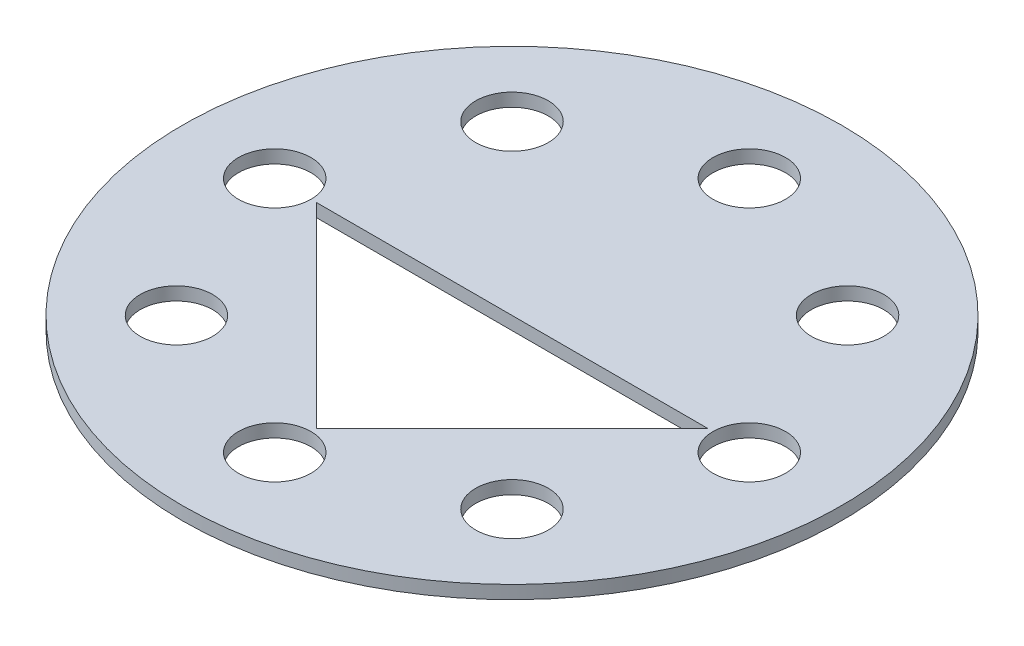
ISO-10303-21;
HEADER;
FILE_DESCRIPTION(('STEP AP214'),'2;1');
FILE_NAME('part.step','',(''),(''),'','','');
FILE_SCHEMA(('AUTOMOTIVE_DESIGN { 1 0 10303 214 1 1 1 1 }'));
ENDSEC;
DATA;
#1=APPLICATION_CONTEXT('core data for automotive mechanical design processes');
#2=APPLICATION_PROTOCOL_DEFINITION('international standard','automotive_design',2000,#1);
#3=PRODUCT_CONTEXT('',#1,'mechanical');
#4=PRODUCT('Part','Part','',(#3));
#5=PRODUCT_RELATED_PRODUCT_CATEGORY('part','',(#4));
#6=PRODUCT_DEFINITION_FORMATION('','',#4);
#7=PRODUCT_DEFINITION_CONTEXT('part definition',#1,'design');
#8=PRODUCT_DEFINITION('design','',#6,#7);
#9=PRODUCT_DEFINITION_SHAPE('','',#8);
#10=(LENGTH_UNIT() NAMED_UNIT(*) SI_UNIT(.MILLI.,.METRE.));
#11=(NAMED_UNIT(*) PLANE_ANGLE_UNIT() SI_UNIT($,.RADIAN.));
#12=(NAMED_UNIT(*) SI_UNIT($,.STERADIAN.) SOLID_ANGLE_UNIT());
#13=UNCERTAINTY_MEASURE_WITH_UNIT(LENGTH_MEASURE(1.E-05),#10,'distance_accuracy_value','');
#14=(GEOMETRIC_REPRESENTATION_CONTEXT(3) GLOBAL_UNCERTAINTY_ASSIGNED_CONTEXT((#13)) GLOBAL_UNIT_ASSIGNED_CONTEXT((#10,
#11,#12)) REPRESENTATION_CONTEXT('',''));
#15=CARTESIAN_POINT('',(0.,0.,0.));
#16=DIRECTION('',(0.,0.,1.));
#17=DIRECTION('',(1.,0.,0.));
#18=AXIS2_PLACEMENT_3D('',#15,#16,#17);
#19=CARTESIAN_POINT('',(0.,1.,0.));
#20=DIRECTION('',(0.,-1.,0.));
#21=DIRECTION('',(0.,0.,-1.));
#22=AXIS2_PLACEMENT_3D('',#19,#20,#21);
#23=CYLINDRICAL_SURFACE('',#22,25.);
#24=CARTESIAN_POINT('',(0.,3.,0.));
#25=DIRECTION('',(0.,1.,0.));
#26=DIRECTION('',(0.,0.,1.));
#27=AXIS2_PLACEMENT_3D('',#24,#25,#26);
#28=CIRCLE('',#27,25.);
#29=CARTESIAN_POINT('',(0.,3.,25.));
#30=VERTEX_POINT('',#29);
#31=EDGE_CURVE('E90',#30,#30,#28,.T.);
#32=ORIENTED_EDGE('',*,*,#31,.F.);
#33=EDGE_LOOP('',(#32));
#34=FACE_BOUND('',#33,.T.);
#35=CARTESIAN_POINT('',(0.,2.,0.));
#36=DIRECTION('',(0.,-1.,0.));
#37=DIRECTION('',(0.,0.,-1.));
#38=AXIS2_PLACEMENT_3D('',#35,#36,#37);
#39=CIRCLE('',#38,25.);
#40=CARTESIAN_POINT('',(0.,2.,-25.));
#41=VERTEX_POINT('',#40);
#42=EDGE_CURVE('E151',#41,#41,#39,.T.);
#43=ORIENTED_EDGE('',*,*,#42,.F.);
#44=EDGE_LOOP('',(#43));
#45=FACE_BOUND('',#44,.T.);
#46=ADVANCED_FACE('F37',(#34,#45),#23,.T.);
#47=CARTESIAN_POINT('',(18.,3.,0.));
#48=DIRECTION('',(0.,-1.,0.));
#49=DIRECTION('',(0.,0.,-1.));
#50=AXIS2_PLACEMENT_3D('',#47,#48,#49);
#51=CYLINDRICAL_SURFACE('',#50,2.75);
#52=CARTESIAN_POINT('',(18.,3.,0.));
#53=DIRECTION('',(0.,1.,0.));
#54=DIRECTION('',(0.,0.,1.));
#55=AXIS2_PLACEMENT_3D('',#52,#53,#54);
#56=CIRCLE('',#55,2.75);
#57=CARTESIAN_POINT('',(18.,3.,2.75));
#58=VERTEX_POINT('',#57);
#59=EDGE_CURVE('E96',#58,#58,#56,.T.);
#60=ORIENTED_EDGE('',*,*,#59,.T.);
#61=EDGE_LOOP('',(#60));
#62=FACE_BOUND('',#61,.T.);
#63=CARTESIAN_POINT('',(18.,2.,0.));
#64=DIRECTION('',(0.,-1.,0.));
#65=DIRECTION('',(0.,0.,-1.));
#66=AXIS2_PLACEMENT_3D('',#63,#64,#65);
#67=CIRCLE('',#66,2.75);
#68=CARTESIAN_POINT('',(18.,2.,-2.75));
#69=VERTEX_POINT('',#68);
#70=EDGE_CURVE('E82',#69,#69,#67,.T.);
#71=ORIENTED_EDGE('',*,*,#70,.T.);
#72=EDGE_LOOP('',(#71));
#73=FACE_BOUND('',#72,.T.);
#74=ADVANCED_FACE('F176',(#62,#73),#51,.F.);
#75=CARTESIAN_POINT('',(12.7279220613578,3.,12.7279220613579));
#76=DIRECTION('',(0.,-1.,0.));
#77=DIRECTION('',(0.,0.,-1.));
#78=AXIS2_PLACEMENT_3D('',#75,#76,#77);
#79=CYLINDRICAL_SURFACE('',#78,2.75);
#80=CARTESIAN_POINT('',(12.7279220613578,3.,12.7279220613579));
#81=DIRECTION('',(0.,1.,0.));
#82=DIRECTION('',(-0.707106781186549,0.,0.707106781186546));
#83=AXIS2_PLACEMENT_3D('',#80,#81,#82);
#84=CIRCLE('',#83,2.75);
#85=CARTESIAN_POINT('',(10.7833784130948,3.,14.6724657096209));
#86=VERTEX_POINT('',#85);
#87=EDGE_CURVE('E100',#86,#86,#84,.T.);
#88=ORIENTED_EDGE('',*,*,#87,.T.);
#89=EDGE_LOOP('',(#88));
#90=FACE_BOUND('',#89,.T.);
#91=CARTESIAN_POINT('',(12.7279220613578,2.,12.7279220613579));
#92=DIRECTION('',(0.,-1.,0.));
#93=DIRECTION('',(0.,0.,-1.));
#94=AXIS2_PLACEMENT_3D('',#91,#92,#93);
#95=CIRCLE('',#94,2.75);
#96=CARTESIAN_POINT('',(12.7279220613578,2.,9.97792206135788));
#97=VERTEX_POINT('',#96);
#98=EDGE_CURVE('E171',#97,#97,#95,.T.);
#99=ORIENTED_EDGE('',*,*,#98,.T.);
#100=EDGE_LOOP('',(#99));
#101=FACE_BOUND('',#100,.T.);
#102=ADVANCED_FACE('F130',(#90,#101),#79,.F.);
#103=CARTESIAN_POINT('',(0.,3.,18.));
#104=DIRECTION('',(0.,-1.,0.));
#105=DIRECTION('',(0.,0.,-1.));
#106=AXIS2_PLACEMENT_3D('',#103,#104,#105);
#107=CYLINDRICAL_SURFACE('',#106,2.75);
#108=CARTESIAN_POINT('',(0.,3.,18.));
#109=DIRECTION('',(0.,1.,0.));
#110=DIRECTION('',(-1.,0.,0.));
#111=AXIS2_PLACEMENT_3D('',#108,#109,#110);
#112=CIRCLE('',#111,2.75);
#113=CARTESIAN_POINT('',(-2.75000000000006,3.,18.));
#114=VERTEX_POINT('',#113);
#115=EDGE_CURVE('E125',#114,#114,#112,.T.);
#116=ORIENTED_EDGE('',*,*,#115,.T.);
#117=EDGE_LOOP('',(#116));
#118=FACE_BOUND('',#117,.T.);
#119=CARTESIAN_POINT('',(0.,2.,18.));
#120=DIRECTION('',(0.,-1.,0.));
#121=DIRECTION('',(0.,0.,-1.));
#122=AXIS2_PLACEMENT_3D('',#119,#120,#121);
#123=CIRCLE('',#122,2.75);
#124=CARTESIAN_POINT('',(0.,2.,15.25));
#125=VERTEX_POINT('',#124);
#126=EDGE_CURVE('E168',#125,#125,#123,.T.);
#127=ORIENTED_EDGE('',*,*,#126,.T.);
#128=EDGE_LOOP('',(#127));
#129=FACE_BOUND('',#128,.T.);
#130=ADVANCED_FACE('F216',(#118,#129),#107,.F.);
#131=CARTESIAN_POINT('',(-12.7279220613579,3.,12.7279220613578));
#132=DIRECTION('',(0.,-1.,0.));
#133=DIRECTION('',(0.,0.,-1.));
#134=AXIS2_PLACEMENT_3D('',#131,#132,#133);
#135=CYLINDRICAL_SURFACE('',#134,2.75);
#136=CARTESIAN_POINT('',(-12.7279220613579,3.,12.7279220613578));
#137=DIRECTION('',(0.,1.,0.));
#138=DIRECTION('',(-0.707106781186544,0.,-0.707106781186551));
#139=AXIS2_PLACEMENT_3D('',#136,#137,#138);
#140=CIRCLE('',#139,2.75);
#141=CARTESIAN_POINT('',(-14.6724657096209,3.,10.7833784130948));
#142=VERTEX_POINT('',#141);
#143=EDGE_CURVE('E122',#142,#142,#140,.T.);
#144=ORIENTED_EDGE('',*,*,#143,.T.);
#145=EDGE_LOOP('',(#144));
#146=FACE_BOUND('',#145,.T.);
#147=CARTESIAN_POINT('',(-12.7279220613579,2.,12.7279220613578));
#148=DIRECTION('',(0.,-1.,0.));
#149=DIRECTION('',(0.,0.,-1.));
#150=AXIS2_PLACEMENT_3D('',#147,#148,#149);
#151=CIRCLE('',#150,2.75);
#152=CARTESIAN_POINT('',(-12.7279220613579,2.,9.97792206135779));
#153=VERTEX_POINT('',#152);
#154=EDGE_CURVE('E165',#153,#153,#151,.T.);
#155=ORIENTED_EDGE('',*,*,#154,.T.);
#156=EDGE_LOOP('',(#155));
#157=FACE_BOUND('',#156,.T.);
#158=ADVANCED_FACE('F257',(#146,#157),#135,.F.);
#159=CARTESIAN_POINT('',(-18.,3.,0.));
#160=DIRECTION('',(0.,-1.,0.));
#161=DIRECTION('',(0.,0.,-1.));
#162=AXIS2_PLACEMENT_3D('',#159,#160,#161);
#163=CYLINDRICAL_SURFACE('',#162,2.75);
#164=CARTESIAN_POINT('',(-18.,3.,0.));
#165=DIRECTION('',(0.,1.,0.));
#166=DIRECTION('',(0.,0.,-1.));
#167=AXIS2_PLACEMENT_3D('',#164,#165,#166);
#168=CIRCLE('',#167,2.75);
#169=CARTESIAN_POINT('',(-18.,3.,-2.75));
#170=VERTEX_POINT('',#169);
#171=EDGE_CURVE('E119',#170,#170,#168,.T.);
#172=ORIENTED_EDGE('',*,*,#171,.T.);
#173=EDGE_LOOP('',(#172));
#174=FACE_BOUND('',#173,.T.);
#175=CARTESIAN_POINT('',(-18.,2.,0.));
#176=DIRECTION('',(0.,-1.,0.));
#177=DIRECTION('',(0.,0.,-1.));
#178=AXIS2_PLACEMENT_3D('',#175,#176,#177);
#179=CIRCLE('',#178,2.75);
#180=CARTESIAN_POINT('',(-18.,2.,-2.75));
#181=VERTEX_POINT('',#180);
#182=EDGE_CURVE('E162',#181,#181,#179,.T.);
#183=ORIENTED_EDGE('',*,*,#182,.T.);
#184=EDGE_LOOP('',(#183));
#185=FACE_BOUND('',#184,.T.);
#186=ADVANCED_FACE('F199',(#174,#185),#163,.F.);
#187=CARTESIAN_POINT('',(-12.7279220613577,3.,-12.727922061358));
#188=DIRECTION('',(0.,-1.,0.));
#189=DIRECTION('',(0.,0.,-1.));
#190=AXIS2_PLACEMENT_3D('',#187,#188,#189);
#191=CYLINDRICAL_SURFACE('',#190,2.75);
#192=CARTESIAN_POINT('',(-12.7279220613577,3.,-12.727922061358));
#193=DIRECTION('',(0.,1.,0.));
#194=DIRECTION('',(0.707106781186554,0.,-0.707106781186541));
#195=AXIS2_PLACEMENT_3D('',#192,#193,#194);
#196=CIRCLE('',#195,2.75);
#197=CARTESIAN_POINT('',(-10.7833784130947,3.,-14.672465709621));
#198=VERTEX_POINT('',#197);
#199=EDGE_CURVE('E116',#198,#198,#196,.T.);
#200=ORIENTED_EDGE('',*,*,#199,.T.);
#201=EDGE_LOOP('',(#200));
#202=FACE_BOUND('',#201,.T.);
#203=CARTESIAN_POINT('',(-12.7279220613577,2.,-12.727922061358));
#204=DIRECTION('',(0.,-1.,0.));
#205=DIRECTION('',(0.,0.,-1.));
#206=AXIS2_PLACEMENT_3D('',#203,#204,#205);
#207=CIRCLE('',#206,2.75);
#208=CARTESIAN_POINT('',(-12.7279220613577,2.,-15.477922061358));
#209=VERTEX_POINT('',#208);
#210=EDGE_CURVE('E153',#209,#209,#207,.T.);
#211=ORIENTED_EDGE('',*,*,#210,.T.);
#212=EDGE_LOOP('',(#211));
#213=FACE_BOUND('',#212,.T.);
#214=ADVANCED_FACE('F193',(#202,#213),#191,.F.);
#215=CARTESIAN_POINT('',(1.88539992297529E-13,3.,-18.));
#216=DIRECTION('',(0.,-1.,0.));
#217=DIRECTION('',(0.,0.,-1.));
#218=AXIS2_PLACEMENT_3D('',#215,#216,#217);
#219=CYLINDRICAL_SURFACE('',#218,2.75);
#220=CARTESIAN_POINT('',(1.88539992297529E-13,3.,-18.));
#221=DIRECTION('',(0.,1.,0.));
#222=DIRECTION('',(1.,0.,0.));
#223=AXIS2_PLACEMENT_3D('',#220,#221,#222);
#224=CIRCLE('',#223,2.75);
#225=CARTESIAN_POINT('',(2.75000000000019,3.,-18.));
#226=VERTEX_POINT('',#225);
#227=EDGE_CURVE('E113',#226,#226,#224,.T.);
#228=ORIENTED_EDGE('',*,*,#227,.T.);
#229=EDGE_LOOP('',(#228));
#230=FACE_BOUND('',#229,.T.);
#231=CARTESIAN_POINT('',(1.88539992297529E-13,2.,-18.));
#232=DIRECTION('',(0.,-1.,0.));
#233=DIRECTION('',(0.,0.,-1.));
#234=AXIS2_PLACEMENT_3D('',#231,#232,#233);
#235=CIRCLE('',#234,2.75);
#236=CARTESIAN_POINT('',(1.88539992297529E-13,2.,-20.75));
#237=VERTEX_POINT('',#236);
#238=EDGE_CURVE('E150',#237,#237,#235,.T.);
#239=ORIENTED_EDGE('',*,*,#238,.T.);
#240=EDGE_LOOP('',(#239));
#241=FACE_BOUND('',#240,.T.);
#242=ADVANCED_FACE('F145',(#230,#241),#219,.F.);
#243=CARTESIAN_POINT('',(12.727922061358,3.,-12.7279220613577));
#244=DIRECTION('',(0.,-1.,0.));
#245=DIRECTION('',(0.,0.,-1.));
#246=AXIS2_PLACEMENT_3D('',#243,#244,#245);
#247=CYLINDRICAL_SURFACE('',#246,2.75);
#248=CARTESIAN_POINT('',(12.727922061358,3.,-12.7279220613577));
#249=DIRECTION('',(0.,1.,0.));
#250=DIRECTION('',(0.707106781186539,0.,0.707106781186556));
#251=AXIS2_PLACEMENT_3D('',#248,#249,#250);
#252=CIRCLE('',#251,2.75);
#253=CARTESIAN_POINT('',(14.672465709621,3.,-10.7833784130947));
#254=VERTEX_POINT('',#253);
#255=EDGE_CURVE('E76',#254,#254,#252,.T.);
#256=ORIENTED_EDGE('',*,*,#255,.T.);
#257=EDGE_LOOP('',(#256));
#258=FACE_BOUND('',#257,.T.);
#259=CARTESIAN_POINT('',(12.727922061358,2.,-12.7279220613577));
#260=DIRECTION('',(0.,-1.,0.));
#261=DIRECTION('',(0.,0.,-1.));
#262=AXIS2_PLACEMENT_3D('',#259,#260,#261);
#263=CIRCLE('',#262,2.75);
#264=CARTESIAN_POINT('',(12.727922061358,2.,-15.4779220613577));
#265=VERTEX_POINT('',#264);
#266=EDGE_CURVE('E40',#265,#265,#263,.T.);
#267=ORIENTED_EDGE('',*,*,#266,.T.);
#268=EDGE_LOOP('',(#267));
#269=FACE_BOUND('',#268,.T.);
#270=ADVANCED_FACE('F134',(#258,#269),#247,.F.);
#271=CARTESIAN_POINT('',(0.,3.,0.));
#272=DIRECTION('',(0.,1.,0.));
#273=DIRECTION('',(0.,0.,1.));
#274=AXIS2_PLACEMENT_3D('',#271,#272,#273);
#275=PLANE('',#274);
#276=ORIENTED_EDGE('',*,*,#227,.F.);
#277=EDGE_LOOP('',(#276));
#278=FACE_BOUND('',#277,.T.);
#279=ORIENTED_EDGE('',*,*,#171,.F.);
#280=EDGE_LOOP('',(#279));
#281=FACE_BOUND('',#280,.T.);
#282=ORIENTED_EDGE('',*,*,#115,.F.);
#283=EDGE_LOOP('',(#282));
#284=FACE_BOUND('',#283,.T.);
#285=ORIENTED_EDGE('',*,*,#59,.F.);
#286=EDGE_LOOP('',(#285));
#287=FACE_BOUND('',#286,.T.);
#288=ORIENTED_EDGE('',*,*,#31,.T.);
#289=EDGE_LOOP('',(#288));
#290=FACE_BOUND('',#289,.T.);
#291=DIRECTION('',(0.707106781186546,0.,-0.707106781186549));
#292=VECTOR('',#291,1.);
#293=CARTESIAN_POINT('',(14.8492424049176,3.,0.));
#294=LINE('',#293,#292);
#295=CARTESIAN_POINT('',(0.,3.,14.8492424049177));
#296=VERTEX_POINT('',#295);
#297=CARTESIAN_POINT('',(14.8492424049176,3.,0.));
#298=VERTEX_POINT('',#297);
#299=EDGE_CURVE('E91',#296,#298,#294,.T.);
#300=ORIENTED_EDGE('',*,*,#299,.F.);
#301=DIRECTION('',(0.707106781186546,0.,0.707106781186549));
#302=VECTOR('',#301,1.);
#303=CARTESIAN_POINT('',(0.,3.,14.8492424049177));
#304=LINE('',#303,#302);
#305=CARTESIAN_POINT('',(-14.8492424049176,3.,0.));
#306=VERTEX_POINT('',#305);
#307=EDGE_CURVE('E93',#306,#296,#304,.T.);
#308=ORIENTED_EDGE('',*,*,#307,.F.);
#309=DIRECTION('',(-1.,0.,0.));
#310=VECTOR('',#309,1.);
#311=CARTESIAN_POINT('',(-14.8492424049176,3.,0.));
#312=LINE('',#311,#310);
#313=EDGE_CURVE('E86',#298,#306,#312,.T.);
#314=ORIENTED_EDGE('',*,*,#313,.F.);
#315=EDGE_LOOP('',(#300,#308,#314));
#316=FACE_BOUND('',#315,.T.);
#317=ORIENTED_EDGE('',*,*,#87,.F.);
#318=EDGE_LOOP('',(#317));
#319=FACE_BOUND('',#318,.T.);
#320=ORIENTED_EDGE('',*,*,#143,.F.);
#321=EDGE_LOOP('',(#320));
#322=FACE_BOUND('',#321,.T.);
#323=ORIENTED_EDGE('',*,*,#199,.F.);
#324=EDGE_LOOP('',(#323));
#325=FACE_BOUND('',#324,.T.);
#326=ORIENTED_EDGE('',*,*,#255,.F.);
#327=EDGE_LOOP('',(#326));
#328=FACE_BOUND('',#327,.T.);
#329=ADVANCED_FACE('F94',(#278,#281,#284,#287,#290,#316,#319,#322,#325,#328),#275,.T.);
#330=CARTESIAN_POINT('',(0.,0.,14.8492424049177));
#331=DIRECTION('',(-0.707106781186549,0.,-0.707106781186546));
#332=DIRECTION('',(-0.707106781186546,0.,0.707106781186549));
#333=AXIS2_PLACEMENT_3D('',#330,#331,#332);
#334=PLANE('',#333);
#335=DIRECTION('',(0.707106781186546,0.,-0.707106781186549));
#336=VECTOR('',#335,1.);
#337=CARTESIAN_POINT('',(14.8492424049176,2.,0.));
#338=LINE('',#337,#336);
#339=CARTESIAN_POINT('',(0.,2.,14.8492424049177));
#340=VERTEX_POINT('',#339);
#341=CARTESIAN_POINT('',(14.8492424049176,2.,0.));
#342=VERTEX_POINT('',#341);
#343=EDGE_CURVE('E53',#340,#342,#338,.T.);
#344=ORIENTED_EDGE('',*,*,#343,.F.);
#345=DIRECTION('',(0.,1.,0.));
#346=VECTOR('',#345,1.);
#347=CARTESIAN_POINT('',(0.,0.,14.8492424049177));
#348=LINE('',#347,#346);
#349=EDGE_CURVE('E45',#340,#296,#348,.T.);
#350=ORIENTED_EDGE('',*,*,#349,.T.);
#351=ORIENTED_EDGE('',*,*,#299,.T.);
#352=DIRECTION('',(0.,1.,0.));
#353=VECTOR('',#352,1.);
#354=CARTESIAN_POINT('',(14.8492424049176,0.,0.));
#355=LINE('',#354,#353);
#356=EDGE_CURVE('E60',#342,#298,#355,.T.);
#357=ORIENTED_EDGE('',*,*,#356,.F.);
#358=EDGE_LOOP('',(#344,#350,#351,#357));
#359=FACE_BOUND('',#358,.T.);
#360=ADVANCED_FACE('F107',(#359),#334,.T.);
#361=CARTESIAN_POINT('',(0.,0.,14.8492424049177));
#362=DIRECTION('',(0.707106781186549,0.,-0.707106781186546));
#363=DIRECTION('',(-0.707106781186546,0.,-0.707106781186549));
#364=AXIS2_PLACEMENT_3D('',#361,#362,#363);
#365=PLANE('',#364);
#366=DIRECTION('',(0.707106781186546,0.,0.707106781186549));
#367=VECTOR('',#366,1.);
#368=CARTESIAN_POINT('',(0.,2.,14.8492424049177));
#369=LINE('',#368,#367);
#370=CARTESIAN_POINT('',(-14.8492424049176,2.,0.));
#371=VERTEX_POINT('',#370);
#372=EDGE_CURVE('E74',#371,#340,#369,.T.);
#373=ORIENTED_EDGE('',*,*,#372,.F.);
#374=DIRECTION('',(0.,1.,0.));
#375=VECTOR('',#374,1.);
#376=CARTESIAN_POINT('',(-14.8492424049176,0.,0.));
#377=LINE('',#376,#375);
#378=EDGE_CURVE('E11',#371,#306,#377,.T.);
#379=ORIENTED_EDGE('',*,*,#378,.T.);
#380=ORIENTED_EDGE('',*,*,#307,.T.);
#381=ORIENTED_EDGE('',*,*,#349,.F.);
#382=EDGE_LOOP('',(#373,#379,#380,#381));
#383=FACE_BOUND('',#382,.T.);
#384=ADVANCED_FACE('F80',(#383),#365,.T.);
#385=CARTESIAN_POINT('',(-15.2027957955108,0.,0.));
#386=DIRECTION('',(0.,0.,-1.));
#387=DIRECTION('',(-1.,0.,0.));
#388=AXIS2_PLACEMENT_3D('',#385,#386,#387);
#389=PLANE('',#388);
#390=ORIENTED_EDGE('',*,*,#378,.F.);
#391=DIRECTION('',(-1.,0.,0.));
#392=VECTOR('',#391,1.);
#393=CARTESIAN_POINT('',(-14.8492424049176,2.,0.));
#394=LINE('',#393,#392);
#395=EDGE_CURVE('E70',#342,#371,#394,.T.);
#396=ORIENTED_EDGE('',*,*,#395,.F.);
#397=ORIENTED_EDGE('',*,*,#356,.T.);
#398=ORIENTED_EDGE('',*,*,#313,.T.);
#399=EDGE_LOOP('',(#390,#396,#397,#398));
#400=FACE_BOUND('',#399,.T.);
#401=ADVANCED_FACE('F84',(#400),#389,.F.);
#402=CARTESIAN_POINT('',(0.,2.,0.));
#403=DIRECTION('',(0.,-1.,0.));
#404=DIRECTION('',(0.,0.,-1.));
#405=AXIS2_PLACEMENT_3D('',#402,#403,#404);
#406=PLANE('',#405);
#407=ORIENTED_EDGE('',*,*,#395,.T.);
#408=ORIENTED_EDGE('',*,*,#372,.T.);
#409=ORIENTED_EDGE('',*,*,#343,.T.);
#410=EDGE_LOOP('',(#407,#408,#409));
#411=FACE_BOUND('',#410,.T.);
#412=ORIENTED_EDGE('',*,*,#70,.F.);
#413=EDGE_LOOP('',(#412));
#414=FACE_BOUND('',#413,.T.);
#415=ORIENTED_EDGE('',*,*,#98,.F.);
#416=EDGE_LOOP('',(#415));
#417=FACE_BOUND('',#416,.T.);
#418=ORIENTED_EDGE('',*,*,#126,.F.);
#419=EDGE_LOOP('',(#418));
#420=FACE_BOUND('',#419,.T.);
#421=ORIENTED_EDGE('',*,*,#154,.F.);
#422=EDGE_LOOP('',(#421));
#423=FACE_BOUND('',#422,.T.);
#424=ORIENTED_EDGE('',*,*,#182,.F.);
#425=EDGE_LOOP('',(#424));
#426=FACE_BOUND('',#425,.T.);
#427=ORIENTED_EDGE('',*,*,#210,.F.);
#428=EDGE_LOOP('',(#427));
#429=FACE_BOUND('',#428,.T.);
#430=ORIENTED_EDGE('',*,*,#238,.F.);
#431=EDGE_LOOP('',(#430));
#432=FACE_BOUND('',#431,.T.);
#433=ORIENTED_EDGE('',*,*,#266,.F.);
#434=EDGE_LOOP('',(#433));
#435=FACE_BOUND('',#434,.T.);
#436=ORIENTED_EDGE('',*,*,#42,.T.);
#437=EDGE_LOOP('',(#436));
#438=FACE_BOUND('',#437,.T.);
#439=ADVANCED_FACE('F72',(#411,#414,#417,#420,#423,#426,#429,#432,#435,#438),#406,.T.);
#440=CLOSED_SHELL('',(#46,#74,#102,#130,#158,#186,#214,#242,#270,#329,#360,#384,#401,#439));
#441=MANIFOLD_SOLID_BREP('B2',#440);
#442=ADVANCED_BREP_SHAPE_REPRESENTATION('',(#18,#441),#14);
#443=SHAPE_DEFINITION_REPRESENTATION(#9,#442);
ENDSEC;
END-ISO-10303-21;
